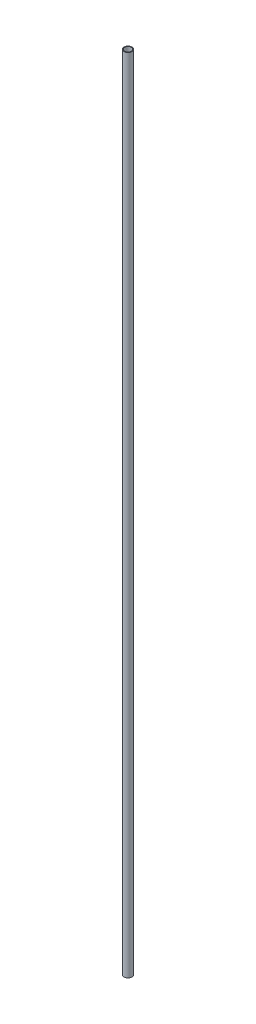
ISO-10303-21;
HEADER;
FILE_DESCRIPTION(('STEP AP214'),'2;1');
FILE_NAME('part.step','',(''),(''),'','','');
FILE_SCHEMA(('AUTOMOTIVE_DESIGN { 1 0 10303 214 1 1 1 1 }'));
ENDSEC;
DATA;
#1=APPLICATION_CONTEXT('core data for automotive mechanical design processes');
#2=APPLICATION_PROTOCOL_DEFINITION('international standard','automotive_design',2000,#1);
#3=PRODUCT_CONTEXT('',#1,'mechanical');
#4=PRODUCT('Part','Part','',(#3));
#5=PRODUCT_RELATED_PRODUCT_CATEGORY('part','',(#4));
#6=PRODUCT_DEFINITION_FORMATION('','',#4);
#7=PRODUCT_DEFINITION_CONTEXT('part definition',#1,'design');
#8=PRODUCT_DEFINITION('design','',#6,#7);
#9=PRODUCT_DEFINITION_SHAPE('','',#8);
#10=(LENGTH_UNIT() NAMED_UNIT(*) SI_UNIT(.MILLI.,.METRE.));
#11=(NAMED_UNIT(*) PLANE_ANGLE_UNIT() SI_UNIT($,.RADIAN.));
#12=(NAMED_UNIT(*) SI_UNIT($,.STERADIAN.) SOLID_ANGLE_UNIT());
#13=UNCERTAINTY_MEASURE_WITH_UNIT(LENGTH_MEASURE(1.E-05),#10,'distance_accuracy_value','');
#14=(GEOMETRIC_REPRESENTATION_CONTEXT(3) GLOBAL_UNCERTAINTY_ASSIGNED_CONTEXT((#13)) GLOBAL_UNIT_ASSIGNED_CONTEXT((#10,
#11,#12)) REPRESENTATION_CONTEXT('',''));
#15=CARTESIAN_POINT('',(0.,0.,0.));
#16=DIRECTION('',(0.,0.,1.));
#17=DIRECTION('',(1.,0.,0.));
#18=AXIS2_PLACEMENT_3D('',#15,#16,#17);
#19=CARTESIAN_POINT('',(0.,3810.,0.));
#20=DIRECTION('',(0.,1.,0.));
#21=DIRECTION('',(0.,0.,1.));
#22=AXIS2_PLACEMENT_3D('',#19,#20,#21);
#23=PLANE('',#22);
#24=CARTESIAN_POINT('',(0.,3810.,0.));
#25=DIRECTION('',(0.,1.,0.));
#26=DIRECTION('',(0.,0.,1.));
#27=AXIS2_PLACEMENT_3D('',#24,#25,#26);
#28=CIRCLE('',#27,38.1);
#29=CARTESIAN_POINT('',(0.,3810.,38.1));
#30=VERTEX_POINT('',#29);
#31=EDGE_CURVE('E10',#30,#30,#28,.T.);
#32=ORIENTED_EDGE('',*,*,#31,.T.);
#33=EDGE_LOOP('',(#32));
#34=FACE_BOUND('',#33,.T.);
#35=CARTESIAN_POINT('',(0.,3810.,0.));
#36=DIRECTION('',(0.,1.,0.));
#37=DIRECTION('',(0.,0.,1.));
#38=AXIS2_PLACEMENT_3D('',#35,#36,#37);
#39=CIRCLE('',#38,31.75);
#40=CARTESIAN_POINT('',(0.,3810.,31.75));
#41=VERTEX_POINT('',#40);
#42=EDGE_CURVE('E42',#41,#41,#39,.T.);
#43=ORIENTED_EDGE('',*,*,#42,.F.);
#44=EDGE_LOOP('',(#43));
#45=FACE_BOUND('',#44,.T.);
#46=ADVANCED_FACE('F31',(#34,#45),#23,.T.);
#47=CARTESIAN_POINT('',(0.,-3810.,0.));
#48=DIRECTION('',(0.,1.,0.));
#49=DIRECTION('',(0.,0.,1.));
#50=AXIS2_PLACEMENT_3D('',#47,#48,#49);
#51=PLANE('',#50);
#52=CARTESIAN_POINT('',(0.,-3810.,0.));
#53=DIRECTION('',(0.,1.,0.));
#54=DIRECTION('',(0.,0.,1.));
#55=AXIS2_PLACEMENT_3D('',#52,#53,#54);
#56=CIRCLE('',#55,38.1);
#57=CARTESIAN_POINT('',(0.,-3810.,38.1));
#58=VERTEX_POINT('',#57);
#59=EDGE_CURVE('E35',#58,#58,#56,.T.);
#60=ORIENTED_EDGE('',*,*,#59,.F.);
#61=EDGE_LOOP('',(#60));
#62=FACE_BOUND('',#61,.T.);
#63=CARTESIAN_POINT('',(0.,-3810.,0.));
#64=DIRECTION('',(0.,1.,0.));
#65=DIRECTION('',(0.,0.,1.));
#66=AXIS2_PLACEMENT_3D('',#63,#64,#65);
#67=CIRCLE('',#66,31.75);
#68=CARTESIAN_POINT('',(0.,-3810.,31.75));
#69=VERTEX_POINT('',#68);
#70=EDGE_CURVE('E44',#69,#69,#67,.T.);
#71=ORIENTED_EDGE('',*,*,#70,.T.);
#72=EDGE_LOOP('',(#71));
#73=FACE_BOUND('',#72,.T.);
#74=ADVANCED_FACE('F54',(#62,#73),#51,.F.);
#75=CARTESIAN_POINT('',(0.,3810.,0.));
#76=DIRECTION('',(0.,-1.,0.));
#77=DIRECTION('',(0.,0.,-1.));
#78=AXIS2_PLACEMENT_3D('',#75,#76,#77);
#79=CYLINDRICAL_SURFACE('',#78,38.1);
#80=ORIENTED_EDGE('',*,*,#31,.F.);
#81=EDGE_LOOP('',(#80));
#82=FACE_BOUND('',#81,.T.);
#83=ORIENTED_EDGE('',*,*,#59,.T.);
#84=EDGE_LOOP('',(#83));
#85=FACE_BOUND('',#84,.T.);
#86=ADVANCED_FACE('F33',(#82,#85),#79,.T.);
#87=CARTESIAN_POINT('',(0.,3810.,0.));
#88=DIRECTION('',(0.,-1.,0.));
#89=DIRECTION('',(0.,0.,-1.));
#90=AXIS2_PLACEMENT_3D('',#87,#88,#89);
#91=CYLINDRICAL_SURFACE('',#90,31.75);
#92=ORIENTED_EDGE('',*,*,#42,.T.);
#93=EDGE_LOOP('',(#92));
#94=FACE_BOUND('',#93,.T.);
#95=ORIENTED_EDGE('',*,*,#70,.F.);
#96=EDGE_LOOP('',(#95));
#97=FACE_BOUND('',#96,.T.);
#98=ADVANCED_FACE('F50',(#94,#97),#91,.F.);
#99=CLOSED_SHELL('',(#46,#74,#86,#98));
#100=MANIFOLD_SOLID_BREP('B2',#99);
#101=ADVANCED_BREP_SHAPE_REPRESENTATION('',(#18,#100),#14);
#102=SHAPE_DEFINITION_REPRESENTATION(#9,#101);
ENDSEC;
END-ISO-10303-21;
